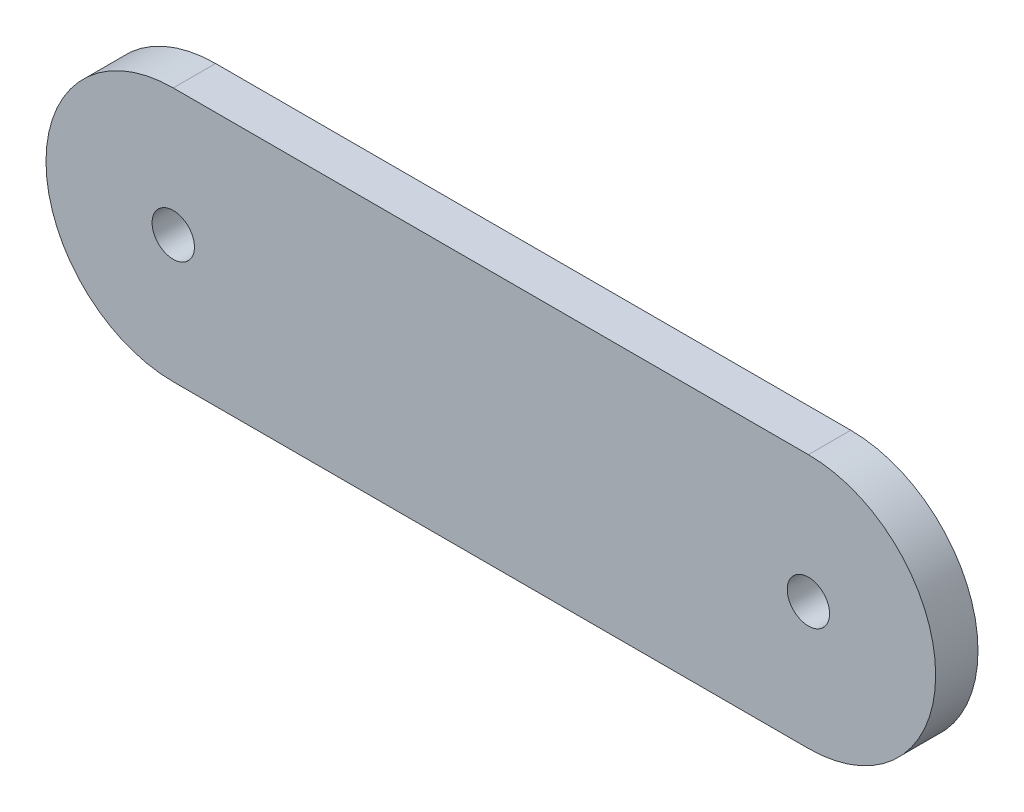
ISO-10303-21;
HEADER;
FILE_DESCRIPTION(('STEP AP214'),'2;1');
FILE_NAME('part.step','',(''),(''),'','','');
FILE_SCHEMA(('AUTOMOTIVE_DESIGN { 1 0 10303 214 1 1 1 1 }'));
ENDSEC;
DATA;
#1=APPLICATION_CONTEXT('core data for automotive mechanical design processes');
#2=APPLICATION_PROTOCOL_DEFINITION('international standard','automotive_design',2000,#1);
#3=PRODUCT_CONTEXT('',#1,'mechanical');
#4=PRODUCT('Part','Part','',(#3));
#5=PRODUCT_RELATED_PRODUCT_CATEGORY('part','',(#4));
#6=PRODUCT_DEFINITION_FORMATION('','',#4);
#7=PRODUCT_DEFINITION_CONTEXT('part definition',#1,'design');
#8=PRODUCT_DEFINITION('design','',#6,#7);
#9=PRODUCT_DEFINITION_SHAPE('','',#8);
#10=(LENGTH_UNIT() NAMED_UNIT(*) SI_UNIT(.MILLI.,.METRE.));
#11=(NAMED_UNIT(*) PLANE_ANGLE_UNIT() SI_UNIT($,.RADIAN.));
#12=(NAMED_UNIT(*) SI_UNIT($,.STERADIAN.) SOLID_ANGLE_UNIT());
#13=UNCERTAINTY_MEASURE_WITH_UNIT(LENGTH_MEASURE(1.E-05),#10,'distance_accuracy_value','');
#14=(GEOMETRIC_REPRESENTATION_CONTEXT(3) GLOBAL_UNCERTAINTY_ASSIGNED_CONTEXT((#13)) GLOBAL_UNIT_ASSIGNED_CONTEXT((#10,
#11,#12)) REPRESENTATION_CONTEXT('',''));
#15=CARTESIAN_POINT('',(0.,0.,0.));
#16=DIRECTION('',(0.,0.,1.));
#17=DIRECTION('',(1.,0.,0.));
#18=AXIS2_PLACEMENT_3D('',#15,#16,#17);
#19=CARTESIAN_POINT('',(-15.,0.,2.));
#20=DIRECTION('',(0.,0.,1.));
#21=DIRECTION('',(1.,0.,0.));
#22=AXIS2_PLACEMENT_3D('',#19,#20,#21);
#23=PLANE('',#22);
#24=CARTESIAN_POINT('',(-15.,0.,2.));
#25=DIRECTION('',(0.,0.,1.));
#26=DIRECTION('',(1.,0.,0.));
#27=AXIS2_PLACEMENT_3D('',#24,#25,#26);
#28=CIRCLE('',#27,1.);
#29=CARTESIAN_POINT('',(-14.,0.,2.));
#30=VERTEX_POINT('',#29);
#31=EDGE_CURVE('E112',#30,#30,#28,.T.);
#32=ORIENTED_EDGE('',*,*,#31,.F.);
#33=EDGE_LOOP('',(#32));
#34=FACE_BOUND('',#33,.T.);
#35=CARTESIAN_POINT('',(-15.,0.,2.));
#36=DIRECTION('',(0.,0.,1.));
#37=DIRECTION('',(1.,0.,0.));
#38=AXIS2_PLACEMENT_3D('',#35,#36,#37);
#39=CIRCLE('',#38,6.00975487909238);
#40=CARTESIAN_POINT('',(-15.,6.00975487909238,2.));
#41=VERTEX_POINT('',#40);
#42=CARTESIAN_POINT('',(-15.,-6.00975487909238,2.));
#43=VERTEX_POINT('',#42);
#44=EDGE_CURVE('E92',#41,#43,#39,.T.);
#45=ORIENTED_EDGE('',*,*,#44,.T.);
#46=DIRECTION('',(1.,0.,0.));
#47=VECTOR('',#46,1.);
#48=CARTESIAN_POINT('',(-15.,-6.00975487909238,2.));
#49=LINE('',#48,#47);
#50=CARTESIAN_POINT('',(15.,-6.00975487909239,2.));
#51=VERTEX_POINT('',#50);
#52=EDGE_CURVE('E87',#43,#51,#49,.T.);
#53=ORIENTED_EDGE('',*,*,#52,.T.);
#54=CARTESIAN_POINT('',(15.,0.,2.));
#55=DIRECTION('',(0.,0.,1.));
#56=DIRECTION('',(1.,0.,0.));
#57=AXIS2_PLACEMENT_3D('',#54,#55,#56);
#58=CIRCLE('',#57,6.00975487909238);
#59=CARTESIAN_POINT('',(15.,6.00975487909239,2.));
#60=VERTEX_POINT('',#59);
#61=EDGE_CURVE('E90',#51,#60,#58,.T.);
#62=ORIENTED_EDGE('',*,*,#61,.T.);
#63=DIRECTION('',(-1.,0.,0.));
#64=VECTOR('',#63,1.);
#65=CARTESIAN_POINT('',(-15.,6.00975487909238,2.));
#66=LINE('',#65,#64);
#67=EDGE_CURVE('E57',#60,#41,#66,.T.);
#68=ORIENTED_EDGE('',*,*,#67,.T.);
#69=EDGE_LOOP('',(#45,#53,#62,#68));
#70=FACE_BOUND('',#69,.T.);
#71=CARTESIAN_POINT('',(15.,0.,2.));
#72=DIRECTION('',(0.,0.,1.));
#73=DIRECTION('',(1.,0.,0.));
#74=AXIS2_PLACEMENT_3D('',#71,#72,#73);
#75=CIRCLE('',#74,1.);
#76=CARTESIAN_POINT('',(16.,0.,2.));
#77=VERTEX_POINT('',#76);
#78=EDGE_CURVE('E134',#77,#77,#75,.T.);
#79=ORIENTED_EDGE('',*,*,#78,.F.);
#80=EDGE_LOOP('',(#79));
#81=FACE_BOUND('',#80,.T.);
#82=ADVANCED_FACE('F39',(#34,#70,#81),#23,.T.);
#83=CARTESIAN_POINT('',(-15.,0.,0.));
#84=DIRECTION('',(0.,0.,1.));
#85=DIRECTION('',(1.,0.,0.));
#86=AXIS2_PLACEMENT_3D('',#83,#84,#85);
#87=PLANE('',#86);
#88=CARTESIAN_POINT('',(-15.,0.,0.));
#89=DIRECTION('',(0.,0.,1.));
#90=DIRECTION('',(1.,0.,0.));
#91=AXIS2_PLACEMENT_3D('',#88,#89,#90);
#92=CIRCLE('',#91,6.00975487909238);
#93=CARTESIAN_POINT('',(-15.,6.00975487909238,0.));
#94=VERTEX_POINT('',#93);
#95=CARTESIAN_POINT('',(-15.,-6.00975487909238,0.));
#96=VERTEX_POINT('',#95);
#97=EDGE_CURVE('E108',#94,#96,#92,.T.);
#98=ORIENTED_EDGE('',*,*,#97,.F.);
#99=DIRECTION('',(-1.,0.,0.));
#100=VECTOR('',#99,1.);
#101=CARTESIAN_POINT('',(-15.,6.00975487909238,0.));
#102=LINE('',#101,#100);
#103=CARTESIAN_POINT('',(15.,6.00975487909239,0.));
#104=VERTEX_POINT('',#103);
#105=EDGE_CURVE('E80',#104,#94,#102,.T.);
#106=ORIENTED_EDGE('',*,*,#105,.F.);
#107=CARTESIAN_POINT('',(15.,0.,0.));
#108=DIRECTION('',(0.,0.,1.));
#109=DIRECTION('',(1.,0.,0.));
#110=AXIS2_PLACEMENT_3D('',#107,#108,#109);
#111=CIRCLE('',#110,6.00975487909238);
#112=CARTESIAN_POINT('',(15.,-6.00975487909239,0.));
#113=VERTEX_POINT('',#112);
#114=EDGE_CURVE('E74',#113,#104,#111,.T.);
#115=ORIENTED_EDGE('',*,*,#114,.F.);
#116=DIRECTION('',(1.,0.,0.));
#117=VECTOR('',#116,1.);
#118=CARTESIAN_POINT('',(-15.,-6.00975487909238,0.));
#119=LINE('',#118,#117);
#120=EDGE_CURVE('E97',#96,#113,#119,.T.);
#121=ORIENTED_EDGE('',*,*,#120,.F.);
#122=EDGE_LOOP('',(#98,#106,#115,#121));
#123=FACE_BOUND('',#122,.T.);
#124=CARTESIAN_POINT('',(-15.,0.,0.));
#125=DIRECTION('',(0.,0.,1.));
#126=DIRECTION('',(1.,0.,0.));
#127=AXIS2_PLACEMENT_3D('',#124,#125,#126);
#128=CIRCLE('',#127,1.);
#129=CARTESIAN_POINT('',(-14.,0.,0.));
#130=VERTEX_POINT('',#129);
#131=EDGE_CURVE('E130',#130,#130,#128,.T.);
#132=ORIENTED_EDGE('',*,*,#131,.T.);
#133=EDGE_LOOP('',(#132));
#134=FACE_BOUND('',#133,.T.);
#135=CARTESIAN_POINT('',(15.,0.,0.));
#136=DIRECTION('',(0.,0.,1.));
#137=DIRECTION('',(1.,0.,0.));
#138=AXIS2_PLACEMENT_3D('',#135,#136,#137);
#139=CIRCLE('',#138,1.);
#140=CARTESIAN_POINT('',(16.,0.,0.));
#141=VERTEX_POINT('',#140);
#142=EDGE_CURVE('E138',#141,#141,#139,.T.);
#143=ORIENTED_EDGE('',*,*,#142,.T.);
#144=EDGE_LOOP('',(#143));
#145=FACE_BOUND('',#144,.T.);
#146=ADVANCED_FACE('F125',(#123,#134,#145),#87,.F.);
#147=CARTESIAN_POINT('',(-15.,0.,2.));
#148=DIRECTION('',(0.,0.,-1.));
#149=DIRECTION('',(-1.,0.,0.));
#150=AXIS2_PLACEMENT_3D('',#147,#148,#149);
#151=CYLINDRICAL_SURFACE('',#150,6.00975487909238);
#152=ORIENTED_EDGE('',*,*,#97,.T.);
#153=DIRECTION('',(0.,0.,-1.));
#154=VECTOR('',#153,1.);
#155=CARTESIAN_POINT('',(-15.,-6.00975487909238,2.));
#156=LINE('',#155,#154);
#157=EDGE_CURVE('E11',#43,#96,#156,.T.);
#158=ORIENTED_EDGE('',*,*,#157,.F.);
#159=ORIENTED_EDGE('',*,*,#44,.F.);
#160=DIRECTION('',(0.,0.,-1.));
#161=VECTOR('',#160,1.);
#162=CARTESIAN_POINT('',(-15.,6.00975487909238,2.));
#163=LINE('',#162,#161);
#164=EDGE_CURVE('E104',#41,#94,#163,.T.);
#165=ORIENTED_EDGE('',*,*,#164,.T.);
#166=EDGE_LOOP('',(#152,#158,#159,#165));
#167=FACE_BOUND('',#166,.T.);
#168=ADVANCED_FACE('F41',(#167),#151,.T.);
#169=CARTESIAN_POINT('',(-15.,-6.00975487909238,2.));
#170=DIRECTION('',(0.,1.,0.));
#171=DIRECTION('',(-1.,0.,0.));
#172=AXIS2_PLACEMENT_3D('',#169,#170,#171);
#173=PLANE('',#172);
#174=ORIENTED_EDGE('',*,*,#120,.T.);
#175=DIRECTION('',(0.,0.,-1.));
#176=VECTOR('',#175,1.);
#177=CARTESIAN_POINT('',(15.,-6.00975487909239,2.));
#178=LINE('',#177,#176);
#179=EDGE_CURVE('E49',#51,#113,#178,.T.);
#180=ORIENTED_EDGE('',*,*,#179,.F.);
#181=ORIENTED_EDGE('',*,*,#52,.F.);
#182=ORIENTED_EDGE('',*,*,#157,.T.);
#183=EDGE_LOOP('',(#174,#180,#181,#182));
#184=FACE_BOUND('',#183,.T.);
#185=ADVANCED_FACE('F96',(#184),#173,.F.);
#186=CARTESIAN_POINT('',(15.,0.,2.));
#187=DIRECTION('',(0.,0.,-1.));
#188=DIRECTION('',(-1.,0.,0.));
#189=AXIS2_PLACEMENT_3D('',#186,#187,#188);
#190=CYLINDRICAL_SURFACE('',#189,6.00975487909238);
#191=ORIENTED_EDGE('',*,*,#114,.T.);
#192=DIRECTION('',(0.,0.,-1.));
#193=VECTOR('',#192,1.);
#194=CARTESIAN_POINT('',(15.,6.00975487909239,2.));
#195=LINE('',#194,#193);
#196=EDGE_CURVE('E99',#60,#104,#195,.T.);
#197=ORIENTED_EDGE('',*,*,#196,.F.);
#198=ORIENTED_EDGE('',*,*,#61,.F.);
#199=ORIENTED_EDGE('',*,*,#179,.T.);
#200=EDGE_LOOP('',(#191,#197,#198,#199));
#201=FACE_BOUND('',#200,.T.);
#202=ADVANCED_FACE('F100',(#201),#190,.T.);
#203=CARTESIAN_POINT('',(-15.,6.00975487909238,2.));
#204=DIRECTION('',(0.,-1.,0.));
#205=DIRECTION('',(1.,0.,0.));
#206=AXIS2_PLACEMENT_3D('',#203,#204,#205);
#207=PLANE('',#206);
#208=ORIENTED_EDGE('',*,*,#105,.T.);
#209=ORIENTED_EDGE('',*,*,#164,.F.);
#210=ORIENTED_EDGE('',*,*,#67,.F.);
#211=ORIENTED_EDGE('',*,*,#196,.T.);
#212=EDGE_LOOP('',(#208,#209,#210,#211));
#213=FACE_BOUND('',#212,.T.);
#214=ADVANCED_FACE('F122',(#213),#207,.F.);
#215=CARTESIAN_POINT('',(-15.,0.,2.));
#216=DIRECTION('',(0.,0.,-1.));
#217=DIRECTION('',(-1.,0.,0.));
#218=AXIS2_PLACEMENT_3D('',#215,#216,#217);
#219=CYLINDRICAL_SURFACE('',#218,1.);
#220=ORIENTED_EDGE('',*,*,#31,.T.);
#221=EDGE_LOOP('',(#220));
#222=FACE_BOUND('',#221,.T.);
#223=ORIENTED_EDGE('',*,*,#131,.F.);
#224=EDGE_LOOP('',(#223));
#225=FACE_BOUND('',#224,.T.);
#226=ADVANCED_FACE('F157',(#222,#225),#219,.F.);
#227=CARTESIAN_POINT('',(15.,0.,2.));
#228=DIRECTION('',(0.,0.,-1.));
#229=DIRECTION('',(-1.,0.,0.));
#230=AXIS2_PLACEMENT_3D('',#227,#228,#229);
#231=CYLINDRICAL_SURFACE('',#230,1.);
#232=ORIENTED_EDGE('',*,*,#78,.T.);
#233=EDGE_LOOP('',(#232));
#234=FACE_BOUND('',#233,.T.);
#235=ORIENTED_EDGE('',*,*,#142,.F.);
#236=EDGE_LOOP('',(#235));
#237=FACE_BOUND('',#236,.T.);
#238=ADVANCED_FACE('F146',(#234,#237),#231,.F.);
#239=CLOSED_SHELL('',(#82,#146,#168,#185,#202,#214,#226,#238));
#240=MANIFOLD_SOLID_BREP('B2',#239);
#241=ADVANCED_BREP_SHAPE_REPRESENTATION('',(#18,#240),#14);
#242=SHAPE_DEFINITION_REPRESENTATION(#9,#241);
ENDSEC;
END-ISO-10303-21;
